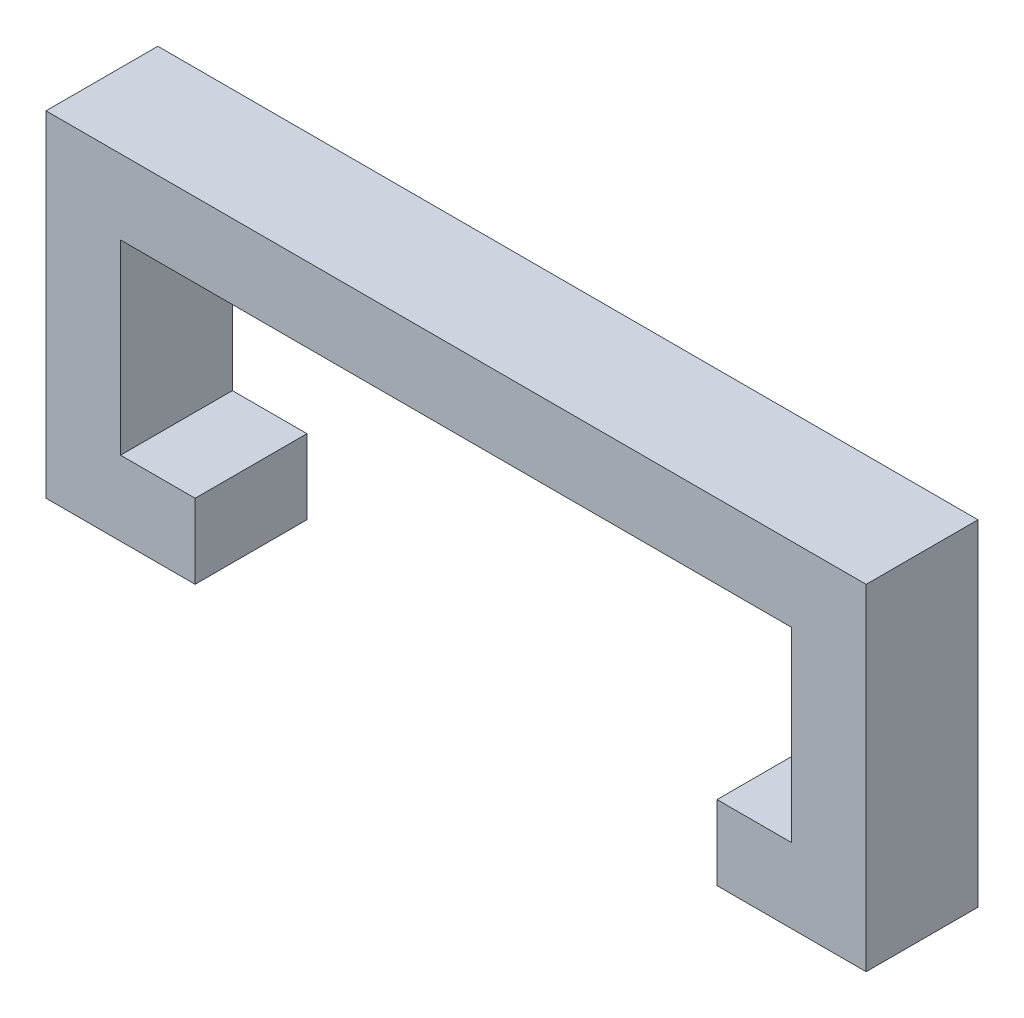
ISO-10303-21;
HEADER;
FILE_DESCRIPTION(('STEP AP214'),'2;1');
FILE_NAME('part.step','',(''),(''),'','','');
FILE_SCHEMA(('AUTOMOTIVE_DESIGN { 1 0 10303 214 1 1 1 1 }'));
ENDSEC;
DATA;
#1=APPLICATION_CONTEXT('core data for automotive mechanical design processes');
#2=APPLICATION_PROTOCOL_DEFINITION('international standard','automotive_design',2000,#1);
#3=PRODUCT_CONTEXT('',#1,'mechanical');
#4=PRODUCT('Part','Part','',(#3));
#5=PRODUCT_RELATED_PRODUCT_CATEGORY('part','',(#4));
#6=PRODUCT_DEFINITION_FORMATION('','',#4);
#7=PRODUCT_DEFINITION_CONTEXT('part definition',#1,'design');
#8=PRODUCT_DEFINITION('design','',#6,#7);
#9=PRODUCT_DEFINITION_SHAPE('','',#8);
#10=(LENGTH_UNIT() NAMED_UNIT(*) SI_UNIT(.MILLI.,.METRE.));
#11=(NAMED_UNIT(*) PLANE_ANGLE_UNIT() SI_UNIT($,.RADIAN.));
#12=(NAMED_UNIT(*) SI_UNIT($,.STERADIAN.) SOLID_ANGLE_UNIT());
#13=UNCERTAINTY_MEASURE_WITH_UNIT(LENGTH_MEASURE(1.E-05),#10,'distance_accuracy_value','');
#14=(GEOMETRIC_REPRESENTATION_CONTEXT(3) GLOBAL_UNCERTAINTY_ASSIGNED_CONTEXT((#13)) GLOBAL_UNIT_ASSIGNED_CONTEXT((#10,
#11,#12)) REPRESENTATION_CONTEXT('',''));
#15=CARTESIAN_POINT('',(0.,0.,0.));
#16=DIRECTION('',(0.,0.,1.));
#17=DIRECTION('',(1.,0.,0.));
#18=AXIS2_PLACEMENT_3D('',#15,#16,#17);
#19=CARTESIAN_POINT('',(-32.7862695015354,12.4012578252732,7.62));
#20=DIRECTION('',(1.,0.,0.));
#21=DIRECTION('',(0.,0.,-1.));
#22=AXIS2_PLACEMENT_3D('',#19,#20,#21);
#23=PLANE('',#22);
#24=DIRECTION('',(0.,-1.,0.));
#25=VECTOR('',#24,1.);
#26=CARTESIAN_POINT('',(-32.7862695015354,12.4012578252732,0.));
#27=LINE('',#26,#25);
#28=CARTESIAN_POINT('',(-32.7862695015354,12.4012578252732,0.));
#29=VERTEX_POINT('',#28);
#30=CARTESIAN_POINT('',(-32.7862695015354,-10.4587421747268,0.));
#31=VERTEX_POINT('',#30);
#32=EDGE_CURVE('E159',#29,#31,#27,.T.);
#33=ORIENTED_EDGE('',*,*,#32,.T.);
#34=DIRECTION('',(0.,0.,-1.));
#35=VECTOR('',#34,1.);
#36=CARTESIAN_POINT('',(-32.7862695015354,-10.4587421747268,7.62));
#37=LINE('',#36,#35);
#38=CARTESIAN_POINT('',(-32.7862695015354,-10.4587421747268,7.62));
#39=VERTEX_POINT('',#38);
#40=EDGE_CURVE('E11',#39,#31,#37,.T.);
#41=ORIENTED_EDGE('',*,*,#40,.F.);
#42=DIRECTION('',(0.,-1.,0.));
#43=VECTOR('',#42,1.);
#44=CARTESIAN_POINT('',(-32.7862695015354,12.4012578252732,7.62));
#45=LINE('',#44,#43);
#46=CARTESIAN_POINT('',(-32.7862695015354,12.4012578252732,7.62));
#47=VERTEX_POINT('',#46);
#48=EDGE_CURVE('E181',#47,#39,#45,.T.);
#49=ORIENTED_EDGE('',*,*,#48,.F.);
#50=DIRECTION('',(0.,0.,-1.));
#51=VECTOR('',#50,1.);
#52=CARTESIAN_POINT('',(-32.7862695015354,12.4012578252732,7.62));
#53=LINE('',#52,#51);
#54=EDGE_CURVE('E155',#47,#29,#53,.T.);
#55=ORIENTED_EDGE('',*,*,#54,.T.);
#56=EDGE_LOOP('',(#33,#41,#49,#55));
#57=FACE_BOUND('',#56,.T.);
#58=ADVANCED_FACE('F39',(#57),#23,.F.);
#59=CARTESIAN_POINT('',(-32.7862695015354,-10.4587421747268,7.62));
#60=DIRECTION('',(0.,1.,0.));
#61=DIRECTION('',(0.,0.,1.));
#62=AXIS2_PLACEMENT_3D('',#59,#60,#61);
#63=PLANE('',#62);
#64=DIRECTION('',(1.,0.,0.));
#65=VECTOR('',#64,1.);
#66=CARTESIAN_POINT('',(-32.7862695015354,-10.4587421747268,0.));
#67=LINE('',#66,#65);
#68=CARTESIAN_POINT('',(-22.6262695015354,-10.4587421747268,0.));
#69=VERTEX_POINT('',#68);
#70=EDGE_CURVE('E162',#31,#69,#67,.T.);
#71=ORIENTED_EDGE('',*,*,#70,.T.);
#72=DIRECTION('',(0.,0.,-1.));
#73=VECTOR('',#72,1.);
#74=CARTESIAN_POINT('',(-22.6262695015354,-10.4587421747268,7.62));
#75=LINE('',#74,#73);
#76=CARTESIAN_POINT('',(-22.6262695015354,-10.4587421747268,7.62));
#77=VERTEX_POINT('',#76);
#78=EDGE_CURVE('E47',#77,#69,#75,.T.);
#79=ORIENTED_EDGE('',*,*,#78,.F.);
#80=DIRECTION('',(1.,0.,0.));
#81=VECTOR('',#80,1.);
#82=CARTESIAN_POINT('',(-32.7862695015354,-10.4587421747268,7.62));
#83=LINE('',#82,#81);
#84=EDGE_CURVE('E110',#39,#77,#83,.T.);
#85=ORIENTED_EDGE('',*,*,#84,.F.);
#86=ORIENTED_EDGE('',*,*,#40,.T.);
#87=EDGE_LOOP('',(#71,#79,#85,#86));
#88=FACE_BOUND('',#87,.T.);
#89=ADVANCED_FACE('F259',(#88),#63,.F.);
#90=CARTESIAN_POINT('',(-22.6262695015354,-5.37874217472679,7.62));
#91=DIRECTION('',(-1.,0.,0.));
#92=DIRECTION('',(0.,0.,1.));
#93=AXIS2_PLACEMENT_3D('',#90,#91,#92);
#94=PLANE('',#93);
#95=DIRECTION('',(0.,1.,0.));
#96=VECTOR('',#95,1.);
#97=CARTESIAN_POINT('',(-22.6262695015354,-5.37874217472679,0.));
#98=LINE('',#97,#96);
#99=CARTESIAN_POINT('',(-22.6262695015354,-5.37874217472679,0.));
#100=VERTEX_POINT('',#99);
#101=EDGE_CURVE('E164',#69,#100,#98,.T.);
#102=ORIENTED_EDGE('',*,*,#101,.T.);
#103=DIRECTION('',(0.,0.,-1.));
#104=VECTOR('',#103,1.);
#105=CARTESIAN_POINT('',(-22.6262695015354,-5.37874217472679,7.62));
#106=LINE('',#105,#104);
#107=CARTESIAN_POINT('',(-22.6262695015354,-5.37874217472679,7.62));
#108=VERTEX_POINT('',#107);
#109=EDGE_CURVE('E200',#108,#100,#106,.T.);
#110=ORIENTED_EDGE('',*,*,#109,.F.);
#111=DIRECTION('',(0.,1.,0.));
#112=VECTOR('',#111,1.);
#113=CARTESIAN_POINT('',(-22.6262695015354,-5.37874217472679,7.62));
#114=LINE('',#113,#112);
#115=EDGE_CURVE('E208',#77,#108,#114,.T.);
#116=ORIENTED_EDGE('',*,*,#115,.F.);
#117=ORIENTED_EDGE('',*,*,#78,.T.);
#118=EDGE_LOOP('',(#102,#110,#116,#117));
#119=FACE_BOUND('',#118,.T.);
#120=ADVANCED_FACE('F206',(#119),#94,.F.);
#121=CARTESIAN_POINT('',(-27.7062695015354,-5.37874217472679,7.62));
#122=DIRECTION('',(0.,-1.,0.));
#123=DIRECTION('',(0.,0.,-1.));
#124=AXIS2_PLACEMENT_3D('',#121,#122,#123);
#125=PLANE('',#124);
#126=DIRECTION('',(-1.,0.,0.));
#127=VECTOR('',#126,1.);
#128=CARTESIAN_POINT('',(-27.7062695015354,-5.37874217472679,0.));
#129=LINE('',#128,#127);
#130=CARTESIAN_POINT('',(-27.7062695015354,-5.37874217472679,0.));
#131=VERTEX_POINT('',#130);
#132=EDGE_CURVE('E166',#100,#131,#129,.T.);
#133=ORIENTED_EDGE('',*,*,#132,.T.);
#134=DIRECTION('',(0.,0.,-1.));
#135=VECTOR('',#134,1.);
#136=CARTESIAN_POINT('',(-27.7062695015354,-5.37874217472679,7.62));
#137=LINE('',#136,#135);
#138=CARTESIAN_POINT('',(-27.7062695015354,-5.37874217472679,7.62));
#139=VERTEX_POINT('',#138);
#140=EDGE_CURVE('E197',#139,#131,#137,.T.);
#141=ORIENTED_EDGE('',*,*,#140,.F.);
#142=DIRECTION('',(-1.,0.,0.));
#143=VECTOR('',#142,1.);
#144=CARTESIAN_POINT('',(-27.7062695015354,-5.37874217472679,7.62));
#145=LINE('',#144,#143);
#146=EDGE_CURVE('E226',#108,#139,#145,.T.);
#147=ORIENTED_EDGE('',*,*,#146,.F.);
#148=ORIENTED_EDGE('',*,*,#109,.T.);
#149=EDGE_LOOP('',(#133,#141,#147,#148));
#150=FACE_BOUND('',#149,.T.);
#151=ADVANCED_FACE('F217',(#150),#125,.F.);
#152=CARTESIAN_POINT('',(-27.7062695015354,7.32125782527321,7.62));
#153=DIRECTION('',(-1.,0.,0.));
#154=DIRECTION('',(0.,0.,1.));
#155=AXIS2_PLACEMENT_3D('',#152,#153,#154);
#156=PLANE('',#155);
#157=DIRECTION('',(0.,1.,0.));
#158=VECTOR('',#157,1.);
#159=CARTESIAN_POINT('',(-27.7062695015354,7.32125782527321,0.));
#160=LINE('',#159,#158);
#161=CARTESIAN_POINT('',(-27.7062695015354,7.32125782527321,0.));
#162=VERTEX_POINT('',#161);
#163=EDGE_CURVE('E168',#131,#162,#160,.T.);
#164=ORIENTED_EDGE('',*,*,#163,.T.);
#165=DIRECTION('',(0.,0.,-1.));
#166=VECTOR('',#165,1.);
#167=CARTESIAN_POINT('',(-27.7062695015354,7.32125782527321,7.62));
#168=LINE('',#167,#166);
#169=CARTESIAN_POINT('',(-27.7062695015354,7.32125782527321,7.62));
#170=VERTEX_POINT('',#169);
#171=EDGE_CURVE('E194',#170,#162,#168,.T.);
#172=ORIENTED_EDGE('',*,*,#171,.F.);
#173=DIRECTION('',(0.,1.,0.));
#174=VECTOR('',#173,1.);
#175=CARTESIAN_POINT('',(-27.7062695015354,7.32125782527321,7.62));
#176=LINE('',#175,#174);
#177=EDGE_CURVE('E223',#139,#170,#176,.T.);
#178=ORIENTED_EDGE('',*,*,#177,.F.);
#179=ORIENTED_EDGE('',*,*,#140,.T.);
#180=EDGE_LOOP('',(#164,#172,#178,#179));
#181=FACE_BOUND('',#180,.T.);
#182=ADVANCED_FACE('F221',(#181),#156,.F.);
#183=CARTESIAN_POINT('',(-27.7062695015354,7.32125782527321,7.62));
#184=DIRECTION('',(0.,1.,0.));
#185=DIRECTION('',(0.,0.,1.));
#186=AXIS2_PLACEMENT_3D('',#183,#184,#185);
#187=PLANE('',#186);
#188=DIRECTION('',(1.,0.,0.));
#189=VECTOR('',#188,1.);
#190=CARTESIAN_POINT('',(-27.7062695015354,7.32125782527321,0.));
#191=LINE('',#190,#189);
#192=CARTESIAN_POINT('',(18.0137304984646,7.32125782527321,0.));
#193=VERTEX_POINT('',#192);
#194=EDGE_CURVE('E170',#162,#193,#191,.T.);
#195=ORIENTED_EDGE('',*,*,#194,.T.);
#196=DIRECTION('',(0.,0.,-1.));
#197=VECTOR('',#196,1.);
#198=CARTESIAN_POINT('',(18.0137304984646,7.32125782527321,7.62));
#199=LINE('',#198,#197);
#200=CARTESIAN_POINT('',(18.0137304984646,7.32125782527321,7.62));
#201=VERTEX_POINT('',#200);
#202=EDGE_CURVE('E191',#201,#193,#199,.T.);
#203=ORIENTED_EDGE('',*,*,#202,.F.);
#204=DIRECTION('',(1.,0.,0.));
#205=VECTOR('',#204,1.);
#206=CARTESIAN_POINT('',(-27.7062695015354,7.32125782527321,7.62));
#207=LINE('',#206,#205);
#208=EDGE_CURVE('E225',#170,#201,#207,.T.);
#209=ORIENTED_EDGE('',*,*,#208,.F.);
#210=ORIENTED_EDGE('',*,*,#171,.T.);
#211=EDGE_LOOP('',(#195,#203,#209,#210));
#212=FACE_BOUND('',#211,.T.);
#213=ADVANCED_FACE('F272',(#212),#187,.F.);
#214=CARTESIAN_POINT('',(18.0137304984646,7.32125782527321,7.62));
#215=DIRECTION('',(1.,0.,0.));
#216=DIRECTION('',(0.,0.,-1.));
#217=AXIS2_PLACEMENT_3D('',#214,#215,#216);
#218=PLANE('',#217);
#219=DIRECTION('',(0.,-1.,0.));
#220=VECTOR('',#219,1.);
#221=CARTESIAN_POINT('',(18.0137304984646,7.32125782527321,0.));
#222=LINE('',#221,#220);
#223=CARTESIAN_POINT('',(18.0137304984646,-5.37874217472679,0.));
#224=VERTEX_POINT('',#223);
#225=EDGE_CURVE('E172',#193,#224,#222,.T.);
#226=ORIENTED_EDGE('',*,*,#225,.T.);
#227=DIRECTION('',(0.,0.,-1.));
#228=VECTOR('',#227,1.);
#229=CARTESIAN_POINT('',(18.0137304984646,-5.37874217472679,7.62));
#230=LINE('',#229,#228);
#231=CARTESIAN_POINT('',(18.0137304984646,-5.37874217472679,7.62));
#232=VERTEX_POINT('',#231);
#233=EDGE_CURVE('E188',#232,#224,#230,.T.);
#234=ORIENTED_EDGE('',*,*,#233,.F.);
#235=DIRECTION('',(0.,-1.,0.));
#236=VECTOR('',#235,1.);
#237=CARTESIAN_POINT('',(18.0137304984646,7.32125782527321,7.62));
#238=LINE('',#237,#236);
#239=EDGE_CURVE('E228',#201,#232,#238,.T.);
#240=ORIENTED_EDGE('',*,*,#239,.F.);
#241=ORIENTED_EDGE('',*,*,#202,.T.);
#242=EDGE_LOOP('',(#226,#234,#240,#241));
#243=FACE_BOUND('',#242,.T.);
#244=ADVANCED_FACE('F275',(#243),#218,.F.);
#245=CARTESIAN_POINT('',(12.9337304984646,-5.37874217472679,7.62));
#246=DIRECTION('',(0.,-1.,0.));
#247=DIRECTION('',(0.,0.,-1.));
#248=AXIS2_PLACEMENT_3D('',#245,#246,#247);
#249=PLANE('',#248);
#250=DIRECTION('',(-1.,0.,0.));
#251=VECTOR('',#250,1.);
#252=CARTESIAN_POINT('',(12.9337304984646,-5.37874217472679,0.));
#253=LINE('',#252,#251);
#254=CARTESIAN_POINT('',(12.9337304984646,-5.37874217472679,0.));
#255=VERTEX_POINT('',#254);
#256=EDGE_CURVE('E174',#224,#255,#253,.T.);
#257=ORIENTED_EDGE('',*,*,#256,.T.);
#258=DIRECTION('',(0.,0.,-1.));
#259=VECTOR('',#258,1.);
#260=CARTESIAN_POINT('',(12.9337304984646,-5.37874217472679,7.62));
#261=LINE('',#260,#259);
#262=CARTESIAN_POINT('',(12.9337304984646,-5.37874217472679,7.62));
#263=VERTEX_POINT('',#262);
#264=EDGE_CURVE('E185',#263,#255,#261,.T.);
#265=ORIENTED_EDGE('',*,*,#264,.F.);
#266=DIRECTION('',(-1.,0.,0.));
#267=VECTOR('',#266,1.);
#268=CARTESIAN_POINT('',(12.9337304984646,-5.37874217472679,7.62));
#269=LINE('',#268,#267);
#270=EDGE_CURVE('E234',#232,#263,#269,.T.);
#271=ORIENTED_EDGE('',*,*,#270,.F.);
#272=ORIENTED_EDGE('',*,*,#233,.T.);
#273=EDGE_LOOP('',(#257,#265,#271,#272));
#274=FACE_BOUND('',#273,.T.);
#275=ADVANCED_FACE('F240',(#274),#249,.F.);
#276=CARTESIAN_POINT('',(12.9337304984646,-5.37874217472679,7.62));
#277=DIRECTION('',(1.,0.,0.));
#278=DIRECTION('',(0.,1.,0.));
#279=AXIS2_PLACEMENT_3D('',#276,#277,#278);
#280=PLANE('',#279);
#281=DIRECTION('',(0.,-1.,0.));
#282=VECTOR('',#281,1.);
#283=CARTESIAN_POINT('',(12.9337304984646,-5.37874217472679,0.));
#284=LINE('',#283,#282);
#285=CARTESIAN_POINT('',(12.9337304984646,-10.4587421747268,0.));
#286=VERTEX_POINT('',#285);
#287=EDGE_CURVE('E176',#255,#286,#284,.T.);
#288=ORIENTED_EDGE('',*,*,#287,.T.);
#289=DIRECTION('',(0.,0.,-1.));
#290=VECTOR('',#289,1.);
#291=CARTESIAN_POINT('',(12.9337304984646,-10.4587421747268,7.62));
#292=LINE('',#291,#290);
#293=CARTESIAN_POINT('',(12.9337304984646,-10.4587421747268,7.62));
#294=VERTEX_POINT('',#293);
#295=EDGE_CURVE('E150',#294,#286,#292,.T.);
#296=ORIENTED_EDGE('',*,*,#295,.F.);
#297=DIRECTION('',(0.,-1.,0.));
#298=VECTOR('',#297,1.);
#299=CARTESIAN_POINT('',(12.9337304984646,-5.37874217472679,7.62));
#300=LINE('',#299,#298);
#301=EDGE_CURVE('E141',#263,#294,#300,.T.);
#302=ORIENTED_EDGE('',*,*,#301,.F.);
#303=ORIENTED_EDGE('',*,*,#264,.T.);
#304=EDGE_LOOP('',(#288,#296,#302,#303));
#305=FACE_BOUND('',#304,.T.);
#306=ADVANCED_FACE('F244',(#305),#280,.F.);
#307=CARTESIAN_POINT('',(12.9337304984646,-10.4587421747268,7.62));
#308=DIRECTION('',(0.,1.,0.));
#309=DIRECTION('',(0.,0.,1.));
#310=AXIS2_PLACEMENT_3D('',#307,#308,#309);
#311=PLANE('',#310);
#312=DIRECTION('',(1.,0.,0.));
#313=VECTOR('',#312,1.);
#314=CARTESIAN_POINT('',(12.9337304984646,-10.4587421747268,0.));
#315=LINE('',#314,#313);
#316=CARTESIAN_POINT('',(23.0937304984646,-10.4587421747268,0.));
#317=VERTEX_POINT('',#316);
#318=EDGE_CURVE('E149',#286,#317,#315,.T.);
#319=ORIENTED_EDGE('',*,*,#318,.T.);
#320=DIRECTION('',(0.,0.,-1.));
#321=VECTOR('',#320,1.);
#322=CARTESIAN_POINT('',(23.0937304984646,-10.4587421747268,7.62));
#323=LINE('',#322,#321);
#324=CARTESIAN_POINT('',(23.0937304984646,-10.4587421747268,7.62));
#325=VERTEX_POINT('',#324);
#326=EDGE_CURVE('E146',#325,#317,#323,.T.);
#327=ORIENTED_EDGE('',*,*,#326,.F.);
#328=DIRECTION('',(1.,0.,0.));
#329=VECTOR('',#328,1.);
#330=CARTESIAN_POINT('',(12.9337304984646,-10.4587421747268,7.62));
#331=LINE('',#330,#329);
#332=EDGE_CURVE('E135',#294,#325,#331,.T.);
#333=ORIENTED_EDGE('',*,*,#332,.F.);
#334=ORIENTED_EDGE('',*,*,#295,.T.);
#335=EDGE_LOOP('',(#319,#327,#333,#334));
#336=FACE_BOUND('',#335,.T.);
#337=ADVANCED_FACE('F147',(#336),#311,.F.);
#338=CARTESIAN_POINT('',(23.0937304984646,12.4012578252732,7.62));
#339=DIRECTION('',(-1.,0.,0.));
#340=DIRECTION('',(0.,-1.,0.));
#341=AXIS2_PLACEMENT_3D('',#338,#339,#340);
#342=PLANE('',#341);
#343=DIRECTION('',(0.,1.,0.));
#344=VECTOR('',#343,1.);
#345=CARTESIAN_POINT('',(23.0937304984646,12.4012578252732,0.));
#346=LINE('',#345,#344);
#347=CARTESIAN_POINT('',(23.0937304984646,12.4012578252732,0.));
#348=VERTEX_POINT('',#347);
#349=EDGE_CURVE('E96',#317,#348,#346,.T.);
#350=ORIENTED_EDGE('',*,*,#349,.T.);
#351=DIRECTION('',(0.,0.,-1.));
#352=VECTOR('',#351,1.);
#353=CARTESIAN_POINT('',(23.0937304984646,12.4012578252732,7.62));
#354=LINE('',#353,#352);
#355=CARTESIAN_POINT('',(23.0937304984646,12.4012578252732,7.62));
#356=VERTEX_POINT('',#355);
#357=EDGE_CURVE('E151',#356,#348,#354,.T.);
#358=ORIENTED_EDGE('',*,*,#357,.F.);
#359=DIRECTION('',(0.,1.,0.));
#360=VECTOR('',#359,1.);
#361=CARTESIAN_POINT('',(23.0937304984646,12.4012578252732,7.62));
#362=LINE('',#361,#360);
#363=EDGE_CURVE('E139',#325,#356,#362,.T.);
#364=ORIENTED_EDGE('',*,*,#363,.F.);
#365=ORIENTED_EDGE('',*,*,#326,.T.);
#366=EDGE_LOOP('',(#350,#358,#364,#365));
#367=FACE_BOUND('',#366,.T.);
#368=ADVANCED_FACE('F153',(#367),#342,.F.);
#369=CARTESIAN_POINT('',(-32.7862695015354,12.4012578252732,7.62));
#370=DIRECTION('',(0.,-1.,0.));
#371=DIRECTION('',(0.,0.,-1.));
#372=AXIS2_PLACEMENT_3D('',#369,#370,#371);
#373=PLANE('',#372);
#374=DIRECTION('',(-1.,0.,0.));
#375=VECTOR('',#374,1.);
#376=CARTESIAN_POINT('',(-32.7862695015354,12.4012578252732,0.));
#377=LINE('',#376,#375);
#378=EDGE_CURVE('E102',#348,#29,#377,.T.);
#379=ORIENTED_EDGE('',*,*,#378,.T.);
#380=ORIENTED_EDGE('',*,*,#54,.F.);
#381=DIRECTION('',(-1.,0.,0.));
#382=VECTOR('',#381,1.);
#383=CARTESIAN_POINT('',(-32.7862695015354,12.4012578252732,7.62));
#384=LINE('',#383,#382);
#385=EDGE_CURVE('E55',#356,#47,#384,.T.);
#386=ORIENTED_EDGE('',*,*,#385,.F.);
#387=ORIENTED_EDGE('',*,*,#357,.T.);
#388=EDGE_LOOP('',(#379,#380,#386,#387));
#389=FACE_BOUND('',#388,.T.);
#390=ADVANCED_FACE('F248',(#389),#373,.F.);
#391=CARTESIAN_POINT('',(0.,0.,7.62));
#392=DIRECTION('',(0.,0.,1.));
#393=DIRECTION('',(1.,0.,0.));
#394=AXIS2_PLACEMENT_3D('',#391,#392,#393);
#395=PLANE('',#394);
#396=ORIENTED_EDGE('',*,*,#48,.T.);
#397=ORIENTED_EDGE('',*,*,#84,.T.);
#398=ORIENTED_EDGE('',*,*,#115,.T.);
#399=ORIENTED_EDGE('',*,*,#146,.T.);
#400=ORIENTED_EDGE('',*,*,#177,.T.);
#401=ORIENTED_EDGE('',*,*,#208,.T.);
#402=ORIENTED_EDGE('',*,*,#239,.T.);
#403=ORIENTED_EDGE('',*,*,#270,.T.);
#404=ORIENTED_EDGE('',*,*,#301,.T.);
#405=ORIENTED_EDGE('',*,*,#332,.T.);
#406=ORIENTED_EDGE('',*,*,#363,.T.);
#407=ORIENTED_EDGE('',*,*,#385,.T.);
#408=EDGE_LOOP('',(#396,#397,#398,#399,#400,#401,#402,#403,#404,#405,#406,#407));
#409=FACE_BOUND('',#408,.T.);
#410=ADVANCED_FACE('F137',(#409),#395,.T.);
#411=CARTESIAN_POINT('',(0.,0.,0.));
#412=DIRECTION('',(0.,0.,1.));
#413=DIRECTION('',(1.,0.,0.));
#414=AXIS2_PLACEMENT_3D('',#411,#412,#413);
#415=PLANE('',#414);
#416=ORIENTED_EDGE('',*,*,#32,.F.);
#417=ORIENTED_EDGE('',*,*,#378,.F.);
#418=ORIENTED_EDGE('',*,*,#349,.F.);
#419=ORIENTED_EDGE('',*,*,#318,.F.);
#420=ORIENTED_EDGE('',*,*,#287,.F.);
#421=ORIENTED_EDGE('',*,*,#256,.F.);
#422=ORIENTED_EDGE('',*,*,#225,.F.);
#423=ORIENTED_EDGE('',*,*,#194,.F.);
#424=ORIENTED_EDGE('',*,*,#163,.F.);
#425=ORIENTED_EDGE('',*,*,#132,.F.);
#426=ORIENTED_EDGE('',*,*,#101,.F.);
#427=ORIENTED_EDGE('',*,*,#70,.F.);
#428=EDGE_LOOP('',(#416,#417,#418,#419,#420,#421,#422,#423,#424,#425,#426,#427));
#429=FACE_BOUND('',#428,.T.);
#430=ADVANCED_FACE('F212',(#429),#415,.F.);
#431=CLOSED_SHELL('',(#58,#89,#120,#151,#182,#213,#244,#275,#306,#337,#368,#390,#410,#430));
#432=MANIFOLD_SOLID_BREP('B2',#431);
#433=ADVANCED_BREP_SHAPE_REPRESENTATION('',(#18,#432),#14);
#434=SHAPE_DEFINITION_REPRESENTATION(#9,#433);
ENDSEC;
END-ISO-10303-21;
